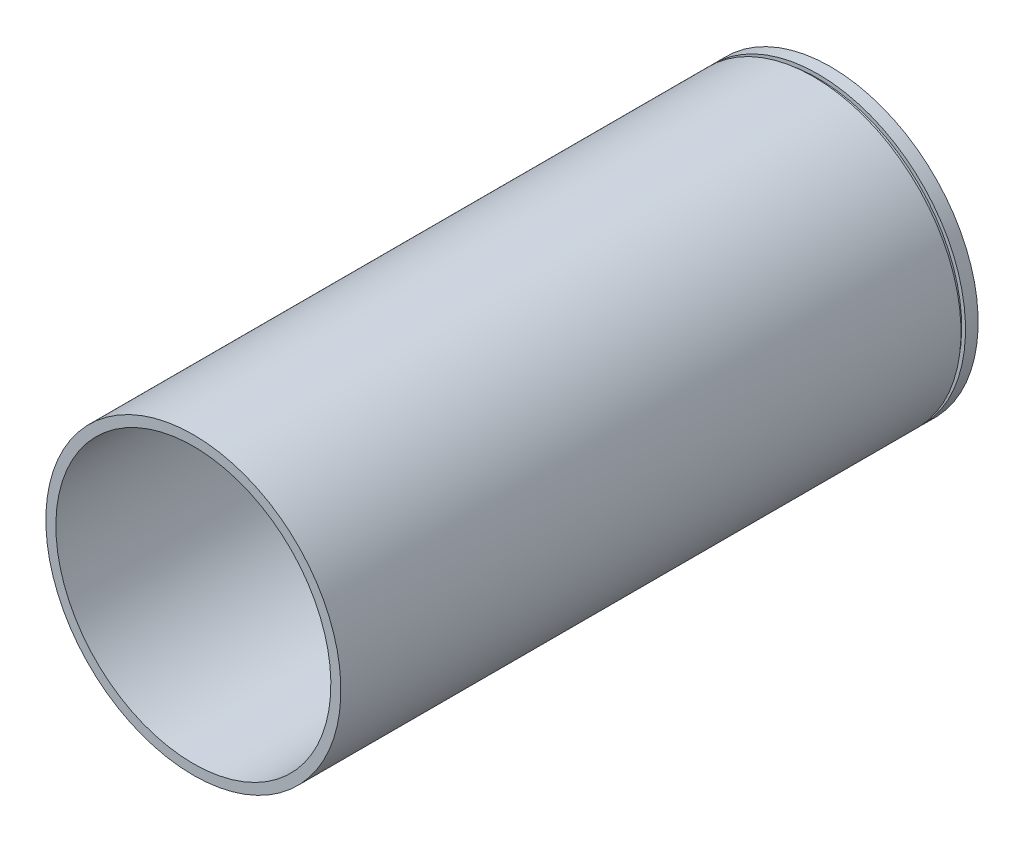
ISO-10303-21;
HEADER;
FILE_DESCRIPTION(('STEP AP214'),'2;1');
FILE_NAME('part.step','',(''),(''),'','','');
FILE_SCHEMA(('AUTOMOTIVE_DESIGN { 1 0 10303 214 1 1 1 1 }'));
ENDSEC;
DATA;
#1=APPLICATION_CONTEXT('core data for automotive mechanical design processes');
#2=APPLICATION_PROTOCOL_DEFINITION('international standard','automotive_design',2000,#1);
#3=PRODUCT_CONTEXT('',#1,'mechanical');
#4=PRODUCT('Part','Part','',(#3));
#5=PRODUCT_RELATED_PRODUCT_CATEGORY('part','',(#4));
#6=PRODUCT_DEFINITION_FORMATION('','',#4);
#7=PRODUCT_DEFINITION_CONTEXT('part definition',#1,'design');
#8=PRODUCT_DEFINITION('design','',#6,#7);
#9=PRODUCT_DEFINITION_SHAPE('','',#8);
#10=(LENGTH_UNIT() NAMED_UNIT(*) SI_UNIT(.MILLI.,.METRE.));
#11=(NAMED_UNIT(*) PLANE_ANGLE_UNIT() SI_UNIT($,.RADIAN.));
#12=(NAMED_UNIT(*) SI_UNIT($,.STERADIAN.) SOLID_ANGLE_UNIT());
#13=UNCERTAINTY_MEASURE_WITH_UNIT(LENGTH_MEASURE(1.E-05),#10,'distance_accuracy_value','');
#14=(GEOMETRIC_REPRESENTATION_CONTEXT(3) GLOBAL_UNCERTAINTY_ASSIGNED_CONTEXT((#13)) GLOBAL_UNIT_ASSIGNED_CONTEXT((#10,
#11,#12)) REPRESENTATION_CONTEXT('',''));
#15=CARTESIAN_POINT('',(0.,0.,0.));
#16=DIRECTION('',(0.,0.,1.));
#17=DIRECTION('',(1.,0.,0.));
#18=AXIS2_PLACEMENT_3D('',#15,#16,#17);
#19=CARTESIAN_POINT('',(0.,136.57,295.));
#20=DIRECTION('',(0.,0.,-1.));
#21=DIRECTION('',(0.,1.,0.));
#22=AXIS2_PLACEMENT_3D('',#19,#20,#21);
#23=PLANE('',#22);
#24=CARTESIAN_POINT('',(0.,0.,295.));
#25=DIRECTION('',(0.,0.,1.));
#26=DIRECTION('',(0.,-1.,0.));
#27=AXIS2_PLACEMENT_3D('',#24,#25,#26);
#28=CIRCLE('',#27,127.3);
#29=CARTESIAN_POINT('',(0.,-127.3,295.));
#30=VERTEX_POINT('',#29);
#31=EDGE_CURVE('E10',#30,#30,#28,.T.);
#32=ORIENTED_EDGE('',*,*,#31,.F.);
#33=EDGE_LOOP('',(#32));
#34=FACE_BOUND('',#33,.T.);
#35=CARTESIAN_POINT('',(0.,0.,295.));
#36=DIRECTION('',(0.,0.,1.));
#37=DIRECTION('',(0.,-1.,0.));
#38=AXIS2_PLACEMENT_3D('',#35,#36,#37);
#39=CIRCLE('',#38,136.57);
#40=CARTESIAN_POINT('',(0.,-136.57,295.));
#41=VERTEX_POINT('',#40);
#42=EDGE_CURVE('E74',#41,#41,#39,.T.);
#43=ORIENTED_EDGE('',*,*,#42,.T.);
#44=EDGE_LOOP('',(#43));
#45=FACE_BOUND('',#44,.T.);
#46=ADVANCED_FACE('F39',(#34,#45),#23,.F.);
#47=CARTESIAN_POINT('',(0.,0.,63.9296014245302));
#48=DIRECTION('',(0.,0.,1.));
#49=DIRECTION('',(0.,-1.,0.));
#50=AXIS2_PLACEMENT_3D('',#47,#48,#49);
#51=CYLINDRICAL_SURFACE('',#50,127.3);
#52=CARTESIAN_POINT('',(0.,0.,-295.));
#53=DIRECTION('',(0.,0.,1.));
#54=DIRECTION('',(0.,-1.,0.));
#55=AXIS2_PLACEMENT_3D('',#52,#53,#54);
#56=CIRCLE('',#55,127.3);
#57=CARTESIAN_POINT('',(0.,-127.3,-295.));
#58=VERTEX_POINT('',#57);
#59=EDGE_CURVE('E46',#58,#58,#56,.T.);
#60=ORIENTED_EDGE('',*,*,#59,.F.);
#61=EDGE_LOOP('',(#60));
#62=FACE_BOUND('',#61,.T.);
#63=ORIENTED_EDGE('',*,*,#31,.T.);
#64=EDGE_LOOP('',(#63));
#65=FACE_BOUND('',#64,.T.);
#66=ADVANCED_FACE('F112',(#62,#65),#51,.F.);
#67=CARTESIAN_POINT('',(0.,136.57,-295.));
#68=DIRECTION('',(0.,0.,1.));
#69=DIRECTION('',(0.,-1.,0.));
#70=AXIS2_PLACEMENT_3D('',#67,#68,#69);
#71=PLANE('',#70);
#72=CARTESIAN_POINT('',(0.,0.,-295.));
#73=DIRECTION('',(0.,0.,1.));
#74=DIRECTION('',(0.,-1.,0.));
#75=AXIS2_PLACEMENT_3D('',#72,#73,#74);
#76=CIRCLE('',#75,136.57);
#77=CARTESIAN_POINT('',(0.,-136.57,-295.));
#78=VERTEX_POINT('',#77);
#79=EDGE_CURVE('E51',#78,#78,#76,.T.);
#80=ORIENTED_EDGE('',*,*,#79,.F.);
#81=EDGE_LOOP('',(#80));
#82=FACE_BOUND('',#81,.T.);
#83=ORIENTED_EDGE('',*,*,#59,.T.);
#84=EDGE_LOOP('',(#83));
#85=FACE_BOUND('',#84,.T.);
#86=ADVANCED_FACE('F107',(#82,#85),#71,.F.);
#87=CARTESIAN_POINT('',(0.,0.,63.9296014245302));
#88=DIRECTION('',(0.,0.,1.));
#89=DIRECTION('',(0.,-1.,0.));
#90=AXIS2_PLACEMENT_3D('',#87,#88,#89);
#91=CYLINDRICAL_SURFACE('',#90,136.57);
#92=CARTESIAN_POINT('',(0.,0.,-283.31152995429));
#93=DIRECTION('',(0.,0.,1.));
#94=DIRECTION('',(0.,-1.,0.));
#95=AXIS2_PLACEMENT_3D('',#92,#93,#94);
#96=CIRCLE('',#95,136.57);
#97=CARTESIAN_POINT('',(0.,-136.57,-283.31152995429));
#98=VERTEX_POINT('',#97);
#99=EDGE_CURVE('E56',#98,#98,#96,.T.);
#100=ORIENTED_EDGE('',*,*,#99,.F.);
#101=EDGE_LOOP('',(#100));
#102=FACE_BOUND('',#101,.T.);
#103=ORIENTED_EDGE('',*,*,#79,.T.);
#104=EDGE_LOOP('',(#103));
#105=FACE_BOUND('',#104,.T.);
#106=ADVANCED_FACE('F101',(#102,#105),#91,.T.);
#107=CARTESIAN_POINT('',(0.,136.57,-283.31152995429));
#108=DIRECTION('',(0.,0.,-1.));
#109=DIRECTION('',(0.,1.,0.));
#110=AXIS2_PLACEMENT_3D('',#107,#108,#109);
#111=PLANE('',#110);
#112=CARTESIAN_POINT('',(0.,0.,-283.31152995429));
#113=DIRECTION('',(0.,0.,1.));
#114=DIRECTION('',(0.,-1.,0.));
#115=AXIS2_PLACEMENT_3D('',#112,#113,#114);
#116=CIRCLE('',#115,133.049061502678);
#117=CARTESIAN_POINT('',(0.,-133.049061502677,-283.31152995429));
#118=VERTEX_POINT('',#117);
#119=EDGE_CURVE('E62',#118,#118,#116,.T.);
#120=ORIENTED_EDGE('',*,*,#119,.F.);
#121=EDGE_LOOP('',(#120));
#122=FACE_BOUND('',#121,.T.);
#123=ORIENTED_EDGE('',*,*,#99,.T.);
#124=EDGE_LOOP('',(#123));
#125=FACE_BOUND('',#124,.T.);
#126=ADVANCED_FACE('F95',(#122,#125),#111,.F.);
#127=CARTESIAN_POINT('',(0.,0.,63.9296014245302));
#128=DIRECTION('',(0.,0.,1.));
#129=DIRECTION('',(0.,-1.,0.));
#130=AXIS2_PLACEMENT_3D('',#127,#128,#129);
#131=CYLINDRICAL_SURFACE('',#130,133.049061502678);
#132=CARTESIAN_POINT('',(0.,0.,-279.114653081848));
#133=DIRECTION('',(0.,0.,1.));
#134=DIRECTION('',(0.,-1.,0.));
#135=AXIS2_PLACEMENT_3D('',#132,#133,#134);
#136=CIRCLE('',#135,133.049061502678);
#137=CARTESIAN_POINT('',(0.,-133.049061502677,-279.114653081848));
#138=VERTEX_POINT('',#137);
#139=EDGE_CURVE('E66',#138,#138,#136,.T.);
#140=ORIENTED_EDGE('',*,*,#139,.F.);
#141=EDGE_LOOP('',(#140));
#142=FACE_BOUND('',#141,.T.);
#143=ORIENTED_EDGE('',*,*,#119,.T.);
#144=EDGE_LOOP('',(#143));
#145=FACE_BOUND('',#144,.T.);
#146=ADVANCED_FACE('F89',(#142,#145),#131,.T.);
#147=CARTESIAN_POINT('',(0.,136.57,-279.114653081848));
#148=DIRECTION('',(0.,0.,1.));
#149=DIRECTION('',(0.,-1.,0.));
#150=AXIS2_PLACEMENT_3D('',#147,#148,#149);
#151=PLANE('',#150);
#152=CARTESIAN_POINT('',(0.,0.,-279.114653081848));
#153=DIRECTION('',(0.,0.,1.));
#154=DIRECTION('',(0.,-1.,0.));
#155=AXIS2_PLACEMENT_3D('',#152,#153,#154);
#156=CIRCLE('',#155,136.57);
#157=CARTESIAN_POINT('',(0.,-136.57,-279.114653081848));
#158=VERTEX_POINT('',#157);
#159=EDGE_CURVE('E70',#158,#158,#156,.T.);
#160=ORIENTED_EDGE('',*,*,#159,.F.);
#161=EDGE_LOOP('',(#160));
#162=FACE_BOUND('',#161,.T.);
#163=ORIENTED_EDGE('',*,*,#139,.T.);
#164=EDGE_LOOP('',(#163));
#165=FACE_BOUND('',#164,.T.);
#166=ADVANCED_FACE('F83',(#162,#165),#151,.F.);
#167=CARTESIAN_POINT('',(0.,0.,63.9296014245302));
#168=DIRECTION('',(0.,0.,1.));
#169=DIRECTION('',(0.,-1.,0.));
#170=AXIS2_PLACEMENT_3D('',#167,#168,#169);
#171=CYLINDRICAL_SURFACE('',#170,136.57);
#172=ORIENTED_EDGE('',*,*,#42,.F.);
#173=EDGE_LOOP('',(#172));
#174=FACE_BOUND('',#173,.T.);
#175=ORIENTED_EDGE('',*,*,#159,.T.);
#176=EDGE_LOOP('',(#175));
#177=FACE_BOUND('',#176,.T.);
#178=ADVANCED_FACE('F80',(#174,#177),#171,.T.);
#179=CLOSED_SHELL('',(#46,#66,#86,#106,#126,#146,#166,#178));
#180=MANIFOLD_SOLID_BREP('B2',#179);
#181=ADVANCED_BREP_SHAPE_REPRESENTATION('',(#18,#180),#14);
#182=SHAPE_DEFINITION_REPRESENTATION(#9,#181);
ENDSEC;
END-ISO-10303-21;
